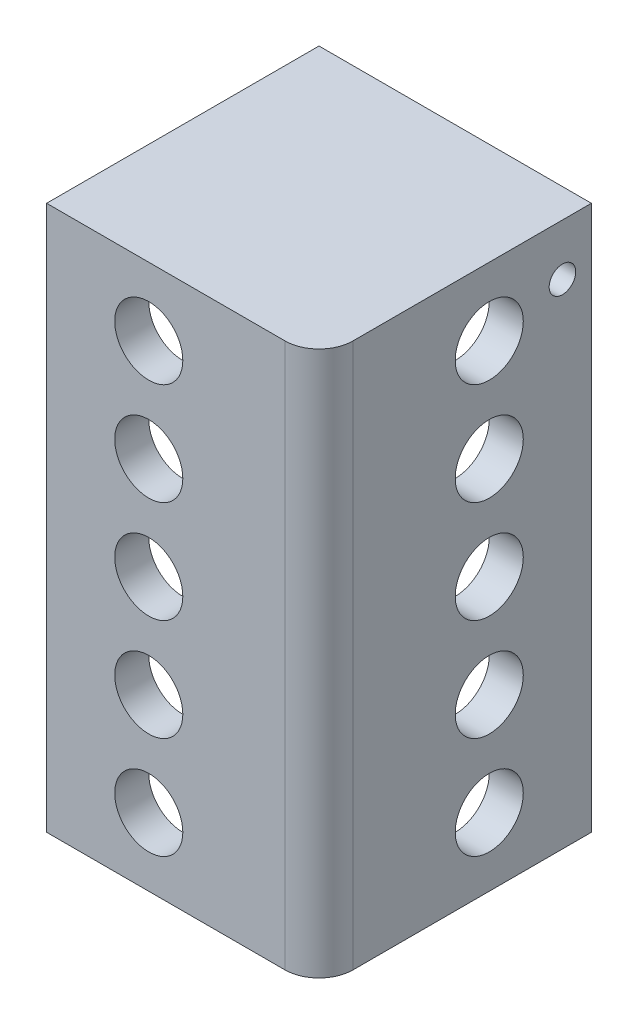
ISO-10303-21;
HEADER;
FILE_DESCRIPTION(('STEP AP214'),'2;1');
FILE_NAME('part.step','',(''),(''),'','','');
FILE_SCHEMA(('AUTOMOTIVE_DESIGN { 1 0 10303 214 1 1 1 1 }'));
ENDSEC;
DATA;
#1=APPLICATION_CONTEXT('core data for automotive mechanical design processes');
#2=APPLICATION_PROTOCOL_DEFINITION('international standard','automotive_design',2000,#1);
#3=PRODUCT_CONTEXT('',#1,'mechanical');
#4=PRODUCT('Part','Part','',(#3));
#5=PRODUCT_RELATED_PRODUCT_CATEGORY('part','',(#4));
#6=PRODUCT_DEFINITION_FORMATION('','',#4);
#7=PRODUCT_DEFINITION_CONTEXT('part definition',#1,'design');
#8=PRODUCT_DEFINITION('design','',#6,#7);
#9=PRODUCT_DEFINITION_SHAPE('','',#8);
#10=(LENGTH_UNIT() NAMED_UNIT(*) SI_UNIT(.MILLI.,.METRE.));
#11=(NAMED_UNIT(*) PLANE_ANGLE_UNIT() SI_UNIT($,.RADIAN.));
#12=(NAMED_UNIT(*) SI_UNIT($,.STERADIAN.) SOLID_ANGLE_UNIT());
#13=UNCERTAINTY_MEASURE_WITH_UNIT(LENGTH_MEASURE(1.E-05),#10,'distance_accuracy_value','');
#14=(GEOMETRIC_REPRESENTATION_CONTEXT(3) GLOBAL_UNCERTAINTY_ASSIGNED_CONTEXT((#13)) GLOBAL_UNIT_ASSIGNED_CONTEXT((#10,
#11,#12)) REPRESENTATION_CONTEXT('',''));
#15=CARTESIAN_POINT('',(0.,0.,0.));
#16=DIRECTION('',(0.,0.,1.));
#17=DIRECTION('',(1.,0.,0.));
#18=AXIS2_PLACEMENT_3D('',#15,#16,#17);
#19=CARTESIAN_POINT('',(0.,196.85,0.));
#20=DIRECTION('',(0.,1.,0.));
#21=DIRECTION('',(0.,0.,1.));
#22=AXIS2_PLACEMENT_3D('',#19,#20,#21);
#23=PLANE('',#22);
#24=DIRECTION('',(0.,0.,-1.));
#25=VECTOR('',#24,1.);
#26=CARTESIAN_POINT('',(7.67057768052518,196.85,-76.4778993435448));
#27=LINE('',#26,#25);
#28=CARTESIAN_POINT('',(7.67057768052518,196.85,-53.6178993435448));
#29=VERTEX_POINT('',#28);
#30=CARTESIAN_POINT('',(7.67057768052518,196.85,-76.4778993435448));
#31=VERTEX_POINT('',#30);
#32=EDGE_CURVE('E187',#29,#31,#27,.T.);
#33=ORIENTED_EDGE('',*,*,#32,.F.);
#34=DIRECTION('',(-1.,0.,0.));
#35=VECTOR('',#34,1.);
#36=CARTESIAN_POINT('',(7.67057768052518,196.85,-53.6178993435448));
#37=LINE('',#36,#35);
#38=CARTESIAN_POINT('',(16.5605776805252,196.85,-53.6178993435448));
#39=VERTEX_POINT('',#38);
#40=EDGE_CURVE('E199',#39,#29,#37,.T.);
#41=ORIENTED_EDGE('',*,*,#40,.F.);
#42=DIRECTION('',(0.,0.,1.));
#43=VECTOR('',#42,1.);
#44=CARTESIAN_POINT('',(16.5605776805252,196.85,-76.4778993435448));
#45=LINE('',#44,#43);
#46=CARTESIAN_POINT('',(16.5605776805252,196.85,-76.4778993435448));
#47=VERTEX_POINT('',#46);
#48=EDGE_CURVE('E203',#47,#39,#45,.T.);
#49=ORIENTED_EDGE('',*,*,#48,.F.);
#50=DIRECTION('',(-1.,0.,0.));
#51=VECTOR('',#50,1.);
#52=CARTESIAN_POINT('',(-41.3514223194748,196.85,-76.4778993435448));
#53=LINE('',#52,#51);
#54=CARTESIAN_POINT('',(28.4985776805252,196.85,-76.4778993435448));
#55=VERTEX_POINT('',#54);
#56=EDGE_CURVE('E295',#55,#47,#53,.T.);
#57=ORIENTED_EDGE('',*,*,#56,.F.);
#58=DIRECTION('',(0.,0.,-1.));
#59=VECTOR('',#58,1.);
#60=CARTESIAN_POINT('',(28.4985776805252,196.85,-53.6178993435448));
#61=LINE('',#60,#59);
#62=CARTESIAN_POINT('',(28.4985776805252,196.85,-53.6178993435448));
#63=VERTEX_POINT('',#62);
#64=EDGE_CURVE('E204',#63,#55,#61,.T.);
#65=ORIENTED_EDGE('',*,*,#64,.F.);
#66=DIRECTION('',(-1.,0.,0.));
#67=VECTOR('',#66,1.);
#68=CARTESIAN_POINT('',(28.4985776805252,196.85,-53.6178993435448));
#69=LINE('',#68,#67);
#70=CARTESIAN_POINT('',(37.3885776805252,196.85,-53.6178993435448));
#71=VERTEX_POINT('',#70);
#72=EDGE_CURVE('E229',#71,#63,#69,.T.);
#73=ORIENTED_EDGE('',*,*,#72,.F.);
#74=DIRECTION('',(0.,0.,1.));
#75=VECTOR('',#74,1.);
#76=CARTESIAN_POINT('',(37.3885776805252,196.85,-53.6178993435448));
#77=LINE('',#76,#75);
#78=CARTESIAN_POINT('',(37.3885776805252,196.85,-76.4778993435448));
#79=VERTEX_POINT('',#78);
#80=EDGE_CURVE('E232',#79,#71,#77,.T.);
#81=ORIENTED_EDGE('',*,*,#80,.F.);
#82=CARTESIAN_POINT('',(47.5485776805252,196.85,-76.4778993435448));
#83=VERTEX_POINT('',#82);
#84=EDGE_CURVE('E291',#83,#79,#53,.T.);
#85=ORIENTED_EDGE('',*,*,#84,.F.);
#86=DIRECTION('',(0.,0.,-1.));
#87=VECTOR('',#86,1.);
#88=CARTESIAN_POINT('',(47.5485776805252,196.85,-76.4778993435448));
#89=LINE('',#88,#87);
#90=CARTESIAN_POINT('',(47.5485776805252,196.85,-0.277899343544857));
#91=VERTEX_POINT('',#90);
#92=EDGE_CURVE('E289',#91,#83,#89,.T.);
#93=ORIENTED_EDGE('',*,*,#92,.F.);
#94=CARTESIAN_POINT('',(34.8485776805252,196.85,-0.277899343544857));
#95=DIRECTION('',(0.,1.,0.));
#96=DIRECTION('',(0.,0.,1.));
#97=AXIS2_PLACEMENT_3D('',#94,#95,#96);
#98=CIRCLE('',#97,12.7);
#99=CARTESIAN_POINT('',(34.8485776805252,196.85,12.4221006564551));
#100=VERTEX_POINT('',#99);
#101=EDGE_CURVE('E341',#91,#100,#98,.F.);
#102=ORIENTED_EDGE('',*,*,#101,.T.);
#103=DIRECTION('',(1.,0.,0.));
#104=VECTOR('',#103,1.);
#105=CARTESIAN_POINT('',(-41.3514223194748,196.85,12.4221006564551));
#106=LINE('',#105,#104);
#107=CARTESIAN_POINT('',(-41.3514223194748,196.85,12.4221006564551));
#108=VERTEX_POINT('',#107);
#109=EDGE_CURVE('E285',#108,#100,#106,.T.);
#110=ORIENTED_EDGE('',*,*,#109,.F.);
#111=DIRECTION('',(0.,0.,1.));
#112=VECTOR('',#111,1.);
#113=CARTESIAN_POINT('',(-41.3514223194748,196.85,-76.4778993435448));
#114=LINE('',#113,#112);
#115=CARTESIAN_POINT('',(-41.3514223194748,196.85,-76.4778993435448));
#116=VERTEX_POINT('',#115);
#117=EDGE_CURVE('E282',#116,#108,#114,.T.);
#118=ORIENTED_EDGE('',*,*,#117,.F.);
#119=EDGE_CURVE('E202',#31,#116,#53,.T.);
#120=ORIENTED_EDGE('',*,*,#119,.F.);
#121=EDGE_LOOP('',(#33,#41,#49,#57,#65,#73,#81,#85,#93,#102,#110,#118,#120));
#122=FACE_BOUND('',#121,.T.);
#123=ADVANCED_FACE('F41',(#122),#23,.F.);
#124=CARTESIAN_POINT('',(-41.3514223194748,203.2,-76.4778993435448));
#125=DIRECTION('',(1.,0.,0.));
#126=DIRECTION('',(0.,0.,-1.));
#127=AXIS2_PLACEMENT_3D('',#124,#125,#126);
#128=PLANE('',#127);
#129=DIRECTION('',(0.,-1.,0.));
#130=VECTOR('',#129,1.);
#131=CARTESIAN_POINT('',(-41.3514223194748,196.85,12.4221006564551));
#132=LINE('',#131,#130);
#133=CARTESIAN_POINT('',(-41.3514223194748,0.,12.4221006564551));
#134=VERTEX_POINT('',#133);
#135=EDGE_CURVE('E297',#108,#134,#132,.T.);
#136=ORIENTED_EDGE('',*,*,#135,.T.);
#137=DIRECTION('',(0.,0.,1.));
#138=VECTOR('',#137,1.);
#139=CARTESIAN_POINT('',(-41.3514223194748,0.,-76.4778993435448));
#140=LINE('',#139,#138);
#141=CARTESIAN_POINT('',(-41.3514223194748,0.,25.1221006564551));
#142=VERTEX_POINT('',#141);
#143=EDGE_CURVE('E299',#134,#142,#140,.T.);
#144=ORIENTED_EDGE('',*,*,#143,.T.);
#145=DIRECTION('',(0.,-1.,0.));
#146=VECTOR('',#145,1.);
#147=CARTESIAN_POINT('',(-41.3514223194748,203.2,25.1221006564551));
#148=LINE('',#147,#146);
#149=CARTESIAN_POINT('',(-41.3514223194748,203.2,25.1221006564551));
#150=VERTEX_POINT('',#149);
#151=EDGE_CURVE('E325',#150,#142,#148,.T.);
#152=ORIENTED_EDGE('',*,*,#151,.F.);
#153=DIRECTION('',(0.,0.,1.));
#154=VECTOR('',#153,1.);
#155=CARTESIAN_POINT('',(-41.3514223194748,203.2,-76.4778993435448));
#156=LINE('',#155,#154);
#157=CARTESIAN_POINT('',(-41.3514223194748,203.2,-76.4778993435448));
#158=VERTEX_POINT('',#157);
#159=EDGE_CURVE('E300',#158,#150,#156,.T.);
#160=ORIENTED_EDGE('',*,*,#159,.F.);
#161=DIRECTION('',(0.,-1.,0.));
#162=VECTOR('',#161,1.);
#163=CARTESIAN_POINT('',(-41.3514223194748,203.2,-76.4778993435448));
#164=LINE('',#163,#162);
#165=EDGE_CURVE('E311',#158,#116,#164,.T.);
#166=ORIENTED_EDGE('',*,*,#165,.T.);
#167=ORIENTED_EDGE('',*,*,#117,.T.);
#168=EDGE_LOOP('',(#136,#144,#152,#160,#166,#167));
#169=FACE_BOUND('',#168,.T.);
#170=ADVANCED_FACE('F458',(#169),#128,.F.);
#171=CARTESIAN_POINT('',(-41.3514223194748,203.2,25.1221006564551));
#172=DIRECTION('',(0.,0.,-1.));
#173=DIRECTION('',(-1.,0.,0.));
#174=AXIS2_PLACEMENT_3D('',#171,#172,#173);
#175=PLANE('',#174);
#176=CARTESIAN_POINT('',(-3.25142231947483,177.8,25.1221006564551));
#177=DIRECTION('',(0.,0.,1.));
#178=DIRECTION('',(1.,0.,0.));
#179=AXIS2_PLACEMENT_3D('',#176,#177,#178);
#180=CIRCLE('',#179,12.7);
#181=CARTESIAN_POINT('',(9.44857768052517,177.8,25.1221006564551));
#182=VERTEX_POINT('',#181);
#183=EDGE_CURVE('E265',#182,#182,#180,.T.);
#184=ORIENTED_EDGE('',*,*,#183,.F.);
#185=EDGE_LOOP('',(#184));
#186=FACE_BOUND('',#185,.T.);
#187=CARTESIAN_POINT('',(-3.25142231947483,139.7,25.1221006564551));
#188=DIRECTION('',(0.,0.,1.));
#189=DIRECTION('',(1.,0.,0.));
#190=AXIS2_PLACEMENT_3D('',#187,#188,#189);
#191=CIRCLE('',#190,12.7);
#192=CARTESIAN_POINT('',(9.44857768052517,139.7,25.1221006564551));
#193=VERTEX_POINT('',#192);
#194=EDGE_CURVE('E269',#193,#193,#191,.T.);
#195=ORIENTED_EDGE('',*,*,#194,.F.);
#196=EDGE_LOOP('',(#195));
#197=FACE_BOUND('',#196,.T.);
#198=CARTESIAN_POINT('',(-3.25142231947483,101.6,25.1221006564551));
#199=DIRECTION('',(0.,0.,1.));
#200=DIRECTION('',(1.,0.,0.));
#201=AXIS2_PLACEMENT_3D('',#198,#199,#200);
#202=CIRCLE('',#201,12.7);
#203=CARTESIAN_POINT('',(9.44857768052517,101.6,25.1221006564551));
#204=VERTEX_POINT('',#203);
#205=EDGE_CURVE('E272',#204,#204,#202,.T.);
#206=ORIENTED_EDGE('',*,*,#205,.F.);
#207=EDGE_LOOP('',(#206));
#208=FACE_BOUND('',#207,.T.);
#209=CARTESIAN_POINT('',(-3.25142231947483,63.5,25.1221006564551));
#210=DIRECTION('',(0.,0.,1.));
#211=DIRECTION('',(1.,0.,0.));
#212=AXIS2_PLACEMENT_3D('',#209,#210,#211);
#213=CIRCLE('',#212,12.7);
#214=CARTESIAN_POINT('',(9.44857768052517,63.5,25.1221006564551));
#215=VERTEX_POINT('',#214);
#216=EDGE_CURVE('E275',#215,#215,#213,.T.);
#217=ORIENTED_EDGE('',*,*,#216,.F.);
#218=EDGE_LOOP('',(#217));
#219=FACE_BOUND('',#218,.T.);
#220=CARTESIAN_POINT('',(-3.25142231947483,25.4,25.1221006564551));
#221=DIRECTION('',(0.,0.,1.));
#222=DIRECTION('',(1.,0.,0.));
#223=AXIS2_PLACEMENT_3D('',#220,#221,#222);
#224=CIRCLE('',#223,12.7);
#225=CARTESIAN_POINT('',(9.44857768052517,25.4,25.1221006564551));
#226=VERTEX_POINT('',#225);
#227=EDGE_CURVE('E278',#226,#226,#224,.T.);
#228=ORIENTED_EDGE('',*,*,#227,.F.);
#229=EDGE_LOOP('',(#228));
#230=FACE_BOUND('',#229,.T.);
#231=DIRECTION('',(1.,0.,0.));
#232=VECTOR('',#231,1.);
#233=CARTESIAN_POINT('',(-41.3514223194748,0.,25.1221006564551));
#234=LINE('',#233,#232);
#235=CARTESIAN_POINT('',(47.5485776805251,0.,25.1221006564551));
#236=VERTEX_POINT('',#235);
#237=EDGE_CURVE('E313',#142,#236,#234,.T.);
#238=ORIENTED_EDGE('',*,*,#237,.T.);
#239=DIRECTION('',(0.,-1.,0.));
#240=VECTOR('',#239,1.);
#241=CARTESIAN_POINT('',(47.5485776805251,203.2,25.1221006564551));
#242=LINE('',#241,#240);
#243=CARTESIAN_POINT('',(47.5485776805251,203.2,25.1221006564551));
#244=VERTEX_POINT('',#243);
#245=EDGE_CURVE('E333',#236,#244,#242,.F.);
#246=ORIENTED_EDGE('',*,*,#245,.T.);
#247=DIRECTION('',(1.,0.,0.));
#248=VECTOR('',#247,1.);
#249=CARTESIAN_POINT('',(-41.3514223194748,203.2,25.1221006564551));
#250=LINE('',#249,#248);
#251=EDGE_CURVE('E303',#150,#244,#250,.T.);
#252=ORIENTED_EDGE('',*,*,#251,.F.);
#253=ORIENTED_EDGE('',*,*,#151,.T.);
#254=EDGE_LOOP('',(#238,#246,#252,#253));
#255=FACE_BOUND('',#254,.T.);
#256=ADVANCED_FACE('F475',(#186,#197,#208,#219,#230,#255),#175,.F.);
#257=CARTESIAN_POINT('',(60.2485776805252,203.2,-76.4778993435448));
#258=DIRECTION('',(-1.,0.,0.));
#259=DIRECTION('',(0.,0.,1.));
#260=AXIS2_PLACEMENT_3D('',#257,#258,#259);
#261=PLANE('',#260);
#262=CARTESIAN_POINT('',(60.2485776805252,184.023,-65.6828993435448));
#263=DIRECTION('',(-1.,0.,0.));
#264=DIRECTION('',(0.,0.,1.));
#265=AXIS2_PLACEMENT_3D('',#262,#263,#264);
#266=CIRCLE('',#265,4.953);
#267=CARTESIAN_POINT('',(60.2485776805252,184.023,-60.7298993435449));
#268=VERTEX_POINT('',#267);
#269=EDGE_CURVE('E613',#268,#268,#266,.T.);
#270=ORIENTED_EDGE('',*,*,#269,.T.);
#271=EDGE_LOOP('',(#270));
#272=FACE_BOUND('',#271,.T.);
#273=CARTESIAN_POINT('',(60.2485776805252,177.8,-38.3778993435448));
#274=DIRECTION('',(1.,0.,0.));
#275=DIRECTION('',(0.,0.,-1.));
#276=AXIS2_PLACEMENT_3D('',#273,#274,#275);
#277=CIRCLE('',#276,12.7);
#278=CARTESIAN_POINT('',(60.2485776805252,177.8,-51.0778993435448));
#279=VERTEX_POINT('',#278);
#280=EDGE_CURVE('E250',#279,#279,#277,.T.);
#281=ORIENTED_EDGE('',*,*,#280,.F.);
#282=EDGE_LOOP('',(#281));
#283=FACE_BOUND('',#282,.T.);
#284=CARTESIAN_POINT('',(60.2485776805252,139.7,-38.3778993435448));
#285=DIRECTION('',(1.,0.,0.));
#286=DIRECTION('',(0.,0.,-1.));
#287=AXIS2_PLACEMENT_3D('',#284,#285,#286);
#288=CIRCLE('',#287,12.7);
#289=CARTESIAN_POINT('',(60.2485776805252,139.7,-51.0778993435448));
#290=VERTEX_POINT('',#289);
#291=EDGE_CURVE('E254',#290,#290,#288,.T.);
#292=ORIENTED_EDGE('',*,*,#291,.F.);
#293=EDGE_LOOP('',(#292));
#294=FACE_BOUND('',#293,.T.);
#295=CARTESIAN_POINT('',(60.2485776805252,101.6,-38.3778993435448));
#296=DIRECTION('',(1.,0.,0.));
#297=DIRECTION('',(0.,0.,-1.));
#298=AXIS2_PLACEMENT_3D('',#295,#296,#297);
#299=CIRCLE('',#298,12.7);
#300=CARTESIAN_POINT('',(60.2485776805252,101.6,-51.0778993435448));
#301=VERTEX_POINT('',#300);
#302=EDGE_CURVE('E257',#301,#301,#299,.T.);
#303=ORIENTED_EDGE('',*,*,#302,.F.);
#304=EDGE_LOOP('',(#303));
#305=FACE_BOUND('',#304,.T.);
#306=CARTESIAN_POINT('',(60.2485776805252,63.5,-38.3778993435448));
#307=DIRECTION('',(1.,0.,0.));
#308=DIRECTION('',(0.,0.,-1.));
#309=AXIS2_PLACEMENT_3D('',#306,#307,#308);
#310=CIRCLE('',#309,12.7);
#311=CARTESIAN_POINT('',(60.2485776805252,63.5,-51.0778993435448));
#312=VERTEX_POINT('',#311);
#313=EDGE_CURVE('E260',#312,#312,#310,.T.);
#314=ORIENTED_EDGE('',*,*,#313,.F.);
#315=EDGE_LOOP('',(#314));
#316=FACE_BOUND('',#315,.T.);
#317=CARTESIAN_POINT('',(60.2485776805252,25.4,-38.3778993435448));
#318=DIRECTION('',(1.,0.,0.));
#319=DIRECTION('',(0.,0.,-1.));
#320=AXIS2_PLACEMENT_3D('',#317,#318,#319);
#321=CIRCLE('',#320,12.7);
#322=CARTESIAN_POINT('',(60.2485776805252,25.4,-51.0778993435448));
#323=VERTEX_POINT('',#322);
#324=EDGE_CURVE('E249',#323,#323,#321,.T.);
#325=ORIENTED_EDGE('',*,*,#324,.F.);
#326=EDGE_LOOP('',(#325));
#327=FACE_BOUND('',#326,.T.);
#328=DIRECTION('',(0.,0.,-1.));
#329=VECTOR('',#328,1.);
#330=CARTESIAN_POINT('',(60.2485776805252,203.2,-76.4778993435448));
#331=LINE('',#330,#329);
#332=CARTESIAN_POINT('',(60.2485776805252,203.2,12.4221006564551));
#333=VERTEX_POINT('',#332);
#334=CARTESIAN_POINT('',(60.2485776805252,203.2,-76.4778993435448));
#335=VERTEX_POINT('',#334);
#336=EDGE_CURVE('E307',#333,#335,#331,.T.);
#337=ORIENTED_EDGE('',*,*,#336,.F.);
#338=DIRECTION('',(0.,-1.,0.));
#339=VECTOR('',#338,1.);
#340=CARTESIAN_POINT('',(60.2485776805252,203.2,12.4221006564551));
#341=LINE('',#340,#339);
#342=CARTESIAN_POINT('',(60.2485776805252,0.,12.4221006564551));
#343=VERTEX_POINT('',#342);
#344=EDGE_CURVE('E328',#333,#343,#341,.T.);
#345=ORIENTED_EDGE('',*,*,#344,.T.);
#346=DIRECTION('',(0.,0.,-1.));
#347=VECTOR('',#346,1.);
#348=CARTESIAN_POINT('',(60.2485776805252,0.,-76.4778993435448));
#349=LINE('',#348,#347);
#350=CARTESIAN_POINT('',(60.2485776805252,0.,-76.4778993435448));
#351=VERTEX_POINT('',#350);
#352=EDGE_CURVE('E316',#343,#351,#349,.T.);
#353=ORIENTED_EDGE('',*,*,#352,.T.);
#354=DIRECTION('',(0.,-1.,0.));
#355=VECTOR('',#354,1.);
#356=CARTESIAN_POINT('',(60.2485776805252,203.2,-76.4778993435448));
#357=LINE('',#356,#355);
#358=EDGE_CURVE('E322',#335,#351,#357,.T.);
#359=ORIENTED_EDGE('',*,*,#358,.F.);
#360=EDGE_LOOP('',(#337,#345,#353,#359));
#361=FACE_BOUND('',#360,.T.);
#362=ADVANCED_FACE('F470',(#272,#283,#294,#305,#316,#327,#361),#261,.F.);
#363=CARTESIAN_POINT('',(-41.3514223194748,203.2,-76.4778993435448));
#364=DIRECTION('',(0.,0.,1.));
#365=DIRECTION('',(1.,0.,0.));
#366=AXIS2_PLACEMENT_3D('',#363,#364,#365);
#367=PLANE('',#366);
#368=DIRECTION('',(0.,1.,0.));
#369=VECTOR('',#368,1.);
#370=CARTESIAN_POINT('',(37.3885776805252,171.45,-76.4778993435448));
#371=LINE('',#370,#369);
#372=CARTESIAN_POINT('',(37.3885776805252,184.15,-76.4778993435448));
#373=VERTEX_POINT('',#372);
#374=EDGE_CURVE('E221',#373,#79,#371,.T.);
#375=ORIENTED_EDGE('',*,*,#374,.F.);
#376=DIRECTION('',(1.,0.,0.));
#377=VECTOR('',#376,1.);
#378=CARTESIAN_POINT('',(28.4985776805252,184.15,-76.4778993435448));
#379=LINE('',#378,#377);
#380=CARTESIAN_POINT('',(28.4985776805252,184.15,-76.4778993435448));
#381=VERTEX_POINT('',#380);
#382=EDGE_CURVE('E395',#373,#381,#379,.F.);
#383=ORIENTED_EDGE('',*,*,#382,.T.);
#384=DIRECTION('',(0.,1.,0.));
#385=VECTOR('',#384,1.);
#386=CARTESIAN_POINT('',(28.4985776805252,171.45,-76.4778993435448));
#387=LINE('',#386,#385);
#388=EDGE_CURVE('E219',#381,#55,#387,.T.);
#389=ORIENTED_EDGE('',*,*,#388,.T.);
#390=ORIENTED_EDGE('',*,*,#56,.T.);
#391=DIRECTION('',(0.,1.,0.));
#392=VECTOR('',#391,1.);
#393=CARTESIAN_POINT('',(16.5605776805252,171.45,-76.4778993435448));
#394=LINE('',#393,#392);
#395=CARTESIAN_POINT('',(16.5605776805252,184.15,-76.4778993435448));
#396=VERTEX_POINT('',#395);
#397=EDGE_CURVE('E214',#396,#47,#394,.T.);
#398=ORIENTED_EDGE('',*,*,#397,.F.);
#399=DIRECTION('',(1.,0.,0.));
#400=VECTOR('',#399,1.);
#401=CARTESIAN_POINT('',(-41.3514223194748,184.15,-76.4778993435448));
#402=LINE('',#401,#400);
#403=CARTESIAN_POINT('',(7.67057768052518,184.15,-76.4778993435448));
#404=VERTEX_POINT('',#403);
#405=EDGE_CURVE('E393',#396,#404,#402,.F.);
#406=ORIENTED_EDGE('',*,*,#405,.T.);
#407=DIRECTION('',(0.,1.,0.));
#408=VECTOR('',#407,1.);
#409=CARTESIAN_POINT('',(7.67057768052518,171.45,-76.4778993435448));
#410=LINE('',#409,#408);
#411=EDGE_CURVE('E216',#404,#31,#410,.T.);
#412=ORIENTED_EDGE('',*,*,#411,.T.);
#413=ORIENTED_EDGE('',*,*,#119,.T.);
#414=ORIENTED_EDGE('',*,*,#165,.F.);
#415=DIRECTION('',(-1.,0.,0.));
#416=VECTOR('',#415,1.);
#417=CARTESIAN_POINT('',(-41.3514223194748,203.2,-76.4778993435448));
#418=LINE('',#417,#416);
#419=EDGE_CURVE('E309',#335,#158,#418,.T.);
#420=ORIENTED_EDGE('',*,*,#419,.F.);
#421=ORIENTED_EDGE('',*,*,#358,.T.);
#422=DIRECTION('',(-1.,0.,0.));
#423=VECTOR('',#422,1.);
#424=CARTESIAN_POINT('',(-41.3514223194748,0.,-76.4778993435448));
#425=LINE('',#424,#423);
#426=CARTESIAN_POINT('',(47.5485776805252,0.,-76.4778993435448));
#427=VERTEX_POINT('',#426);
#428=EDGE_CURVE('E304',#351,#427,#425,.T.);
#429=ORIENTED_EDGE('',*,*,#428,.T.);
#430=DIRECTION('',(0.,-1.,0.));
#431=VECTOR('',#430,1.);
#432=CARTESIAN_POINT('',(47.5485776805252,196.85,-76.4778993435448));
#433=LINE('',#432,#431);
#434=EDGE_CURVE('E294',#83,#427,#433,.T.);
#435=ORIENTED_EDGE('',*,*,#434,.F.);
#436=ORIENTED_EDGE('',*,*,#84,.T.);
#437=EDGE_LOOP('',(#375,#383,#389,#390,#398,#406,#412,#413,#414,#420,#421,#429,#435,#436));
#438=FACE_BOUND('',#437,.T.);
#439=ADVANCED_FACE('F408',(#438),#367,.F.);
#440=CARTESIAN_POINT('',(0.,203.2,0.));
#441=DIRECTION('',(0.,1.,0.));
#442=DIRECTION('',(0.,0.,1.));
#443=AXIS2_PLACEMENT_3D('',#440,#441,#442);
#444=PLANE('',#443);
#445=ORIENTED_EDGE('',*,*,#251,.T.);
#446=CARTESIAN_POINT('',(47.5485776805252,203.2,12.4221006564551));
#447=DIRECTION('',(0.,1.,0.));
#448=DIRECTION('',(0.,0.,1.));
#449=AXIS2_PLACEMENT_3D('',#446,#447,#448);
#450=CIRCLE('',#449,12.7);
#451=EDGE_CURVE('E335',#244,#333,#450,.T.);
#452=ORIENTED_EDGE('',*,*,#451,.T.);
#453=ORIENTED_EDGE('',*,*,#336,.T.);
#454=ORIENTED_EDGE('',*,*,#419,.T.);
#455=ORIENTED_EDGE('',*,*,#159,.T.);
#456=EDGE_LOOP('',(#445,#452,#453,#454,#455));
#457=FACE_BOUND('',#456,.T.);
#458=ADVANCED_FACE('F465',(#457),#444,.T.);
#459=CARTESIAN_POINT('',(0.,0.,0.));
#460=DIRECTION('',(0.,1.,0.));
#461=DIRECTION('',(0.,0.,1.));
#462=AXIS2_PLACEMENT_3D('',#459,#460,#461);
#463=PLANE('',#462);
#464=CARTESIAN_POINT('',(34.8485776805252,0.,-0.277899343544854));
#465=DIRECTION('',(0.,1.,0.));
#466=DIRECTION('',(0.,0.,1.));
#467=AXIS2_PLACEMENT_3D('',#464,#465,#466);
#468=CIRCLE('',#467,12.7);
#469=CARTESIAN_POINT('',(34.8485776805251,0.,12.4221006564551));
#470=VERTEX_POINT('',#469);
#471=CARTESIAN_POINT('',(47.5485776805252,0.,-0.277899343544948));
#472=VERTEX_POINT('',#471);
#473=EDGE_CURVE('E243',#470,#472,#468,.T.);
#474=ORIENTED_EDGE('',*,*,#473,.T.);
#475=DIRECTION('',(0.,0.,-1.));
#476=VECTOR('',#475,1.);
#477=CARTESIAN_POINT('',(47.5485776805252,0.,-76.4778993435448));
#478=LINE('',#477,#476);
#479=EDGE_CURVE('E246',#472,#427,#478,.T.);
#480=ORIENTED_EDGE('',*,*,#479,.T.);
#481=ORIENTED_EDGE('',*,*,#428,.F.);
#482=ORIENTED_EDGE('',*,*,#352,.F.);
#483=CARTESIAN_POINT('',(47.5485776805252,0.,12.4221006564551));
#484=DIRECTION('',(0.,1.,0.));
#485=DIRECTION('',(0.,0.,1.));
#486=AXIS2_PLACEMENT_3D('',#483,#484,#485);
#487=CIRCLE('',#486,12.7);
#488=EDGE_CURVE('E331',#343,#236,#487,.F.);
#489=ORIENTED_EDGE('',*,*,#488,.T.);
#490=ORIENTED_EDGE('',*,*,#237,.F.);
#491=ORIENTED_EDGE('',*,*,#143,.F.);
#492=DIRECTION('',(1.,0.,0.));
#493=VECTOR('',#492,1.);
#494=CARTESIAN_POINT('',(-41.3514223194748,0.,12.4221006564551));
#495=LINE('',#494,#493);
#496=EDGE_CURVE('E218',#134,#470,#495,.T.);
#497=ORIENTED_EDGE('',*,*,#496,.T.);
#498=EDGE_LOOP('',(#474,#480,#481,#482,#489,#490,#491,#497));
#499=FACE_BOUND('',#498,.T.);
#500=ADVANCED_FACE('F445',(#499),#463,.F.);
#501=CARTESIAN_POINT('',(-41.3514223194748,196.85,12.4221006564551));
#502=DIRECTION('',(0.,0.,-1.));
#503=DIRECTION('',(-1.,0.,0.));
#504=AXIS2_PLACEMENT_3D('',#501,#502,#503);
#505=PLANE('',#504);
#506=CARTESIAN_POINT('',(-3.25142231947483,177.8,12.4221006564551));
#507=DIRECTION('',(0.,0.,-1.));
#508=DIRECTION('',(-1.,0.,0.));
#509=AXIS2_PLACEMENT_3D('',#506,#507,#508);
#510=CIRCLE('',#509,12.7);
#511=CARTESIAN_POINT('',(-15.9514223194748,177.8,12.4221006564551));
#512=VERTEX_POINT('',#511);
#513=EDGE_CURVE('E286',#512,#512,#510,.T.);
#514=ORIENTED_EDGE('',*,*,#513,.F.);
#515=EDGE_LOOP('',(#514));
#516=FACE_BOUND('',#515,.T.);
#517=CARTESIAN_POINT('',(-3.25142231947483,139.7,12.4221006564551));
#518=DIRECTION('',(0.,0.,-1.));
#519=DIRECTION('',(-1.,0.,0.));
#520=AXIS2_PLACEMENT_3D('',#517,#518,#519);
#521=CIRCLE('',#520,12.7);
#522=CARTESIAN_POINT('',(-15.9514223194748,139.7,12.4221006564551));
#523=VERTEX_POINT('',#522);
#524=EDGE_CURVE('E352',#523,#523,#521,.T.);
#525=ORIENTED_EDGE('',*,*,#524,.F.);
#526=EDGE_LOOP('',(#525));
#527=FACE_BOUND('',#526,.T.);
#528=CARTESIAN_POINT('',(-3.25142231947483,101.6,12.4221006564551));
#529=DIRECTION('',(0.,0.,-1.));
#530=DIRECTION('',(-1.,0.,0.));
#531=AXIS2_PLACEMENT_3D('',#528,#529,#530);
#532=CIRCLE('',#531,12.7);
#533=CARTESIAN_POINT('',(-15.9514223194748,101.6,12.4221006564551));
#534=VERTEX_POINT('',#533);
#535=EDGE_CURVE('E349',#534,#534,#532,.T.);
#536=ORIENTED_EDGE('',*,*,#535,.F.);
#537=EDGE_LOOP('',(#536));
#538=FACE_BOUND('',#537,.T.);
#539=CARTESIAN_POINT('',(-3.25142231947483,63.5,12.4221006564551));
#540=DIRECTION('',(0.,0.,-1.));
#541=DIRECTION('',(-1.,0.,0.));
#542=AXIS2_PLACEMENT_3D('',#539,#540,#541);
#543=CIRCLE('',#542,12.7);
#544=CARTESIAN_POINT('',(-15.9514223194748,63.5,12.4221006564551));
#545=VERTEX_POINT('',#544);
#546=EDGE_CURVE('E346',#545,#545,#543,.T.);
#547=ORIENTED_EDGE('',*,*,#546,.F.);
#548=EDGE_LOOP('',(#547));
#549=FACE_BOUND('',#548,.T.);
#550=CARTESIAN_POINT('',(-3.25142231947483,25.4,12.4221006564551));
#551=DIRECTION('',(0.,0.,-1.));
#552=DIRECTION('',(-1.,0.,0.));
#553=AXIS2_PLACEMENT_3D('',#550,#551,#552);
#554=CIRCLE('',#553,12.7);
#555=CARTESIAN_POINT('',(-15.9514223194748,25.4,12.4221006564551));
#556=VERTEX_POINT('',#555);
#557=EDGE_CURVE('E268',#556,#556,#554,.T.);
#558=ORIENTED_EDGE('',*,*,#557,.F.);
#559=EDGE_LOOP('',(#558));
#560=FACE_BOUND('',#559,.T.);
#561=ORIENTED_EDGE('',*,*,#109,.T.);
#562=DIRECTION('',(0.,-1.,0.));
#563=VECTOR('',#562,1.);
#564=CARTESIAN_POINT('',(34.8485776805252,6.34999999999999,12.4221006564551));
#565=LINE('',#564,#563);
#566=EDGE_CURVE('E337',#100,#470,#565,.T.);
#567=ORIENTED_EDGE('',*,*,#566,.T.);
#568=ORIENTED_EDGE('',*,*,#496,.F.);
#569=ORIENTED_EDGE('',*,*,#135,.F.);
#570=EDGE_LOOP('',(#561,#567,#568,#569));
#571=FACE_BOUND('',#570,.T.);
#572=ADVANCED_FACE('F456',(#516,#527,#538,#549,#560,#571),#505,.T.);
#573=CARTESIAN_POINT('',(47.5485776805252,196.85,-76.4778993435448));
#574=DIRECTION('',(-1.,0.,0.));
#575=DIRECTION('',(0.,0.,1.));
#576=AXIS2_PLACEMENT_3D('',#573,#574,#575);
#577=PLANE('',#576);
#578=CARTESIAN_POINT('',(47.5485776805252,184.023,-65.6828993435448));
#579=DIRECTION('',(-1.,0.,0.));
#580=DIRECTION('',(0.,0.,1.));
#581=AXIS2_PLACEMENT_3D('',#578,#579,#580);
#582=CIRCLE('',#581,4.953);
#583=CARTESIAN_POINT('',(47.5485776805252,184.023,-60.7298993435449));
#584=VERTEX_POINT('',#583);
#585=EDGE_CURVE('E222',#584,#584,#582,.T.);
#586=ORIENTED_EDGE('',*,*,#585,.F.);
#587=EDGE_LOOP('',(#586));
#588=FACE_BOUND('',#587,.T.);
#589=CARTESIAN_POINT('',(47.5485776805252,177.8,-38.3778993435448));
#590=DIRECTION('',(-1.,0.,0.));
#591=DIRECTION('',(0.,0.,1.));
#592=AXIS2_PLACEMENT_3D('',#589,#590,#591);
#593=CIRCLE('',#592,12.7);
#594=CARTESIAN_POINT('',(47.5485776805252,177.8,-25.6778993435448));
#595=VERTEX_POINT('',#594);
#596=EDGE_CURVE('E281',#595,#595,#593,.T.);
#597=ORIENTED_EDGE('',*,*,#596,.F.);
#598=EDGE_LOOP('',(#597));
#599=FACE_BOUND('',#598,.T.);
#600=CARTESIAN_POINT('',(47.5485776805252,139.7,-38.3778993435448));
#601=DIRECTION('',(-1.,0.,0.));
#602=DIRECTION('',(0.,0.,1.));
#603=AXIS2_PLACEMENT_3D('',#600,#601,#602);
#604=CIRCLE('',#603,12.7);
#605=CARTESIAN_POINT('',(47.5485776805252,139.7,-25.6778993435448));
#606=VERTEX_POINT('',#605);
#607=EDGE_CURVE('E365',#606,#606,#604,.T.);
#608=ORIENTED_EDGE('',*,*,#607,.F.);
#609=EDGE_LOOP('',(#608));
#610=FACE_BOUND('',#609,.T.);
#611=CARTESIAN_POINT('',(47.5485776805252,101.6,-38.3778993435448));
#612=DIRECTION('',(-1.,0.,0.));
#613=DIRECTION('',(0.,0.,1.));
#614=AXIS2_PLACEMENT_3D('',#611,#612,#613);
#615=CIRCLE('',#614,12.7);
#616=CARTESIAN_POINT('',(47.5485776805252,101.6,-25.6778993435448));
#617=VERTEX_POINT('',#616);
#618=EDGE_CURVE('E362',#617,#617,#615,.T.);
#619=ORIENTED_EDGE('',*,*,#618,.F.);
#620=EDGE_LOOP('',(#619));
#621=FACE_BOUND('',#620,.T.);
#622=CARTESIAN_POINT('',(47.5485776805252,63.5,-38.3778993435448));
#623=DIRECTION('',(-1.,0.,0.));
#624=DIRECTION('',(0.,0.,1.));
#625=AXIS2_PLACEMENT_3D('',#622,#623,#624);
#626=CIRCLE('',#625,12.7);
#627=CARTESIAN_POINT('',(47.5485776805252,63.5,-25.6778993435448));
#628=VERTEX_POINT('',#627);
#629=EDGE_CURVE('E359',#628,#628,#626,.T.);
#630=ORIENTED_EDGE('',*,*,#629,.F.);
#631=EDGE_LOOP('',(#630));
#632=FACE_BOUND('',#631,.T.);
#633=CARTESIAN_POINT('',(47.5485776805252,25.4,-38.3778993435448));
#634=DIRECTION('',(-1.,0.,0.));
#635=DIRECTION('',(0.,0.,1.));
#636=AXIS2_PLACEMENT_3D('',#633,#634,#635);
#637=CIRCLE('',#636,12.7);
#638=CARTESIAN_POINT('',(47.5485776805252,25.4,-25.6778993435448));
#639=VERTEX_POINT('',#638);
#640=EDGE_CURVE('E253',#639,#639,#637,.T.);
#641=ORIENTED_EDGE('',*,*,#640,.F.);
#642=EDGE_LOOP('',(#641));
#643=FACE_BOUND('',#642,.T.);
#644=ORIENTED_EDGE('',*,*,#434,.T.);
#645=ORIENTED_EDGE('',*,*,#479,.F.);
#646=DIRECTION('',(0.,-1.,0.));
#647=VECTOR('',#646,1.);
#648=CARTESIAN_POINT('',(47.5485776805252,196.85,-0.277899343544859));
#649=LINE('',#648,#647);
#650=EDGE_CURVE('E339',#472,#91,#649,.F.);
#651=ORIENTED_EDGE('',*,*,#650,.T.);
#652=ORIENTED_EDGE('',*,*,#92,.T.);
#653=EDGE_LOOP('',(#644,#645,#651,#652));
#654=FACE_BOUND('',#653,.T.);
#655=ADVANCED_FACE('F443',(#588,#599,#610,#621,#632,#643,#654),#577,.T.);
#656=CARTESIAN_POINT('',(47.5485776805252,203.2,12.4221006564551));
#657=DIRECTION('',(0.,-1.,0.));
#658=DIRECTION('',(0.,0.,-1.));
#659=AXIS2_PLACEMENT_3D('',#656,#657,#658);
#660=CYLINDRICAL_SURFACE('',#659,12.7);
#661=ORIENTED_EDGE('',*,*,#451,.F.);
#662=ORIENTED_EDGE('',*,*,#245,.F.);
#663=ORIENTED_EDGE('',*,*,#488,.F.);
#664=ORIENTED_EDGE('',*,*,#344,.F.);
#665=EDGE_LOOP('',(#661,#662,#663,#664));
#666=FACE_BOUND('',#665,.T.);
#667=ADVANCED_FACE('F476',(#666),#660,.T.);
#668=CARTESIAN_POINT('',(34.8485776805252,196.85,-0.277899343544857));
#669=DIRECTION('',(0.,1.,0.));
#670=DIRECTION('',(0.,0.,1.));
#671=AXIS2_PLACEMENT_3D('',#668,#669,#670);
#672=CYLINDRICAL_SURFACE('',#671,12.7);
#673=ORIENTED_EDGE('',*,*,#101,.F.);
#674=ORIENTED_EDGE('',*,*,#650,.F.);
#675=ORIENTED_EDGE('',*,*,#473,.F.);
#676=ORIENTED_EDGE('',*,*,#566,.F.);
#677=EDGE_LOOP('',(#673,#674,#675,#676));
#678=FACE_BOUND('',#677,.T.);
#679=ADVANCED_FACE('F453',(#678),#672,.F.);
#680=CARTESIAN_POINT('',(-3.25142231947483,25.4,-76.4778993435448));
#681=DIRECTION('',(0.,0.,1.));
#682=DIRECTION('',(1.,0.,0.));
#683=AXIS2_PLACEMENT_3D('',#680,#681,#682);
#684=CYLINDRICAL_SURFACE('',#683,12.7);
#685=ORIENTED_EDGE('',*,*,#557,.T.);
#686=EDGE_LOOP('',(#685));
#687=FACE_BOUND('',#686,.T.);
#688=ORIENTED_EDGE('',*,*,#227,.T.);
#689=EDGE_LOOP('',(#688));
#690=FACE_BOUND('',#689,.T.);
#691=ADVANCED_FACE('F484',(#687,#690),#684,.F.);
#692=CARTESIAN_POINT('',(-3.25142231947483,63.5,-76.4778993435448));
#693=DIRECTION('',(0.,0.,1.));
#694=DIRECTION('',(1.,0.,0.));
#695=AXIS2_PLACEMENT_3D('',#692,#693,#694);
#696=CYLINDRICAL_SURFACE('',#695,12.7);
#697=ORIENTED_EDGE('',*,*,#546,.T.);
#698=EDGE_LOOP('',(#697));
#699=FACE_BOUND('',#698,.T.);
#700=ORIENTED_EDGE('',*,*,#216,.T.);
#701=EDGE_LOOP('',(#700));
#702=FACE_BOUND('',#701,.T.);
#703=ADVANCED_FACE('F524',(#699,#702),#696,.F.);
#704=CARTESIAN_POINT('',(-3.25142231947483,101.6,-76.4778993435448));
#705=DIRECTION('',(0.,0.,1.));
#706=DIRECTION('',(1.,0.,0.));
#707=AXIS2_PLACEMENT_3D('',#704,#705,#706);
#708=CYLINDRICAL_SURFACE('',#707,12.7);
#709=ORIENTED_EDGE('',*,*,#535,.T.);
#710=EDGE_LOOP('',(#709));
#711=FACE_BOUND('',#710,.T.);
#712=ORIENTED_EDGE('',*,*,#205,.T.);
#713=EDGE_LOOP('',(#712));
#714=FACE_BOUND('',#713,.T.);
#715=ADVANCED_FACE('F529',(#711,#714),#708,.F.);
#716=CARTESIAN_POINT('',(-3.25142231947483,139.7,-76.4778993435448));
#717=DIRECTION('',(0.,0.,1.));
#718=DIRECTION('',(1.,0.,0.));
#719=AXIS2_PLACEMENT_3D('',#716,#717,#718);
#720=CYLINDRICAL_SURFACE('',#719,12.7);
#721=ORIENTED_EDGE('',*,*,#524,.T.);
#722=EDGE_LOOP('',(#721));
#723=FACE_BOUND('',#722,.T.);
#724=ORIENTED_EDGE('',*,*,#194,.T.);
#725=EDGE_LOOP('',(#724));
#726=FACE_BOUND('',#725,.T.);
#727=ADVANCED_FACE('F536',(#723,#726),#720,.F.);
#728=CARTESIAN_POINT('',(-3.25142231947483,177.8,-76.4778993435448));
#729=DIRECTION('',(0.,0.,1.));
#730=DIRECTION('',(1.,0.,0.));
#731=AXIS2_PLACEMENT_3D('',#728,#729,#730);
#732=CYLINDRICAL_SURFACE('',#731,12.7);
#733=ORIENTED_EDGE('',*,*,#513,.T.);
#734=EDGE_LOOP('',(#733));
#735=FACE_BOUND('',#734,.T.);
#736=ORIENTED_EDGE('',*,*,#183,.T.);
#737=EDGE_LOOP('',(#736));
#738=FACE_BOUND('',#737,.T.);
#739=ADVANCED_FACE('F543',(#735,#738),#732,.F.);
#740=CARTESIAN_POINT('',(-41.3514223194748,25.4,-38.3778993435448));
#741=DIRECTION('',(1.,0.,0.));
#742=DIRECTION('',(0.,0.,-1.));
#743=AXIS2_PLACEMENT_3D('',#740,#741,#742);
#744=CYLINDRICAL_SURFACE('',#743,12.7);
#745=ORIENTED_EDGE('',*,*,#640,.T.);
#746=EDGE_LOOP('',(#745));
#747=FACE_BOUND('',#746,.T.);
#748=ORIENTED_EDGE('',*,*,#324,.T.);
#749=EDGE_LOOP('',(#748));
#750=FACE_BOUND('',#749,.T.);
#751=ADVANCED_FACE('F547',(#747,#750),#744,.F.);
#752=CARTESIAN_POINT('',(-41.3514223194748,63.5,-38.3778993435448));
#753=DIRECTION('',(1.,0.,0.));
#754=DIRECTION('',(0.,0.,-1.));
#755=AXIS2_PLACEMENT_3D('',#752,#753,#754);
#756=CYLINDRICAL_SURFACE('',#755,12.7);
#757=ORIENTED_EDGE('',*,*,#629,.T.);
#758=EDGE_LOOP('',(#757));
#759=FACE_BOUND('',#758,.T.);
#760=ORIENTED_EDGE('',*,*,#313,.T.);
#761=EDGE_LOOP('',(#760));
#762=FACE_BOUND('',#761,.T.);
#763=ADVANCED_FACE('F551',(#759,#762),#756,.F.);
#764=CARTESIAN_POINT('',(-41.3514223194748,101.6,-38.3778993435448));
#765=DIRECTION('',(1.,0.,0.));
#766=DIRECTION('',(0.,0.,-1.));
#767=AXIS2_PLACEMENT_3D('',#764,#765,#766);
#768=CYLINDRICAL_SURFACE('',#767,12.7);
#769=ORIENTED_EDGE('',*,*,#618,.T.);
#770=EDGE_LOOP('',(#769));
#771=FACE_BOUND('',#770,.T.);
#772=ORIENTED_EDGE('',*,*,#302,.T.);
#773=EDGE_LOOP('',(#772));
#774=FACE_BOUND('',#773,.T.);
#775=ADVANCED_FACE('F555',(#771,#774),#768,.F.);
#776=CARTESIAN_POINT('',(-41.3514223194748,139.7,-38.3778993435448));
#777=DIRECTION('',(1.,0.,0.));
#778=DIRECTION('',(0.,0.,-1.));
#779=AXIS2_PLACEMENT_3D('',#776,#777,#778);
#780=CYLINDRICAL_SURFACE('',#779,12.7);
#781=ORIENTED_EDGE('',*,*,#607,.T.);
#782=EDGE_LOOP('',(#781));
#783=FACE_BOUND('',#782,.T.);
#784=ORIENTED_EDGE('',*,*,#291,.T.);
#785=EDGE_LOOP('',(#784));
#786=FACE_BOUND('',#785,.T.);
#787=ADVANCED_FACE('F559',(#783,#786),#780,.F.);
#788=CARTESIAN_POINT('',(-41.3514223194748,177.8,-38.3778993435448));
#789=DIRECTION('',(1.,0.,0.));
#790=DIRECTION('',(0.,0.,-1.));
#791=AXIS2_PLACEMENT_3D('',#788,#789,#790);
#792=CYLINDRICAL_SURFACE('',#791,12.7);
#793=ORIENTED_EDGE('',*,*,#596,.T.);
#794=EDGE_LOOP('',(#793));
#795=FACE_BOUND('',#794,.T.);
#796=ORIENTED_EDGE('',*,*,#280,.T.);
#797=EDGE_LOOP('',(#796));
#798=FACE_BOUND('',#797,.T.);
#799=ADVANCED_FACE('F563',(#795,#798),#792,.F.);
#800=CARTESIAN_POINT('',(28.4985776805252,171.45,-53.6178993435448));
#801=DIRECTION('',(1.,0.,0.));
#802=DIRECTION('',(0.,0.,-1.));
#803=AXIS2_PLACEMENT_3D('',#800,#801,#802);
#804=PLANE('',#803);
#805=CARTESIAN_POINT('',(28.4985776805252,184.023,-65.6828993435448));
#806=DIRECTION('',(1.,0.,0.));
#807=DIRECTION('',(0.,0.,-1.));
#808=AXIS2_PLACEMENT_3D('',#805,#806,#807);
#809=CIRCLE('',#808,4.953);
#810=CARTESIAN_POINT('',(28.4985776805252,184.023,-70.6358993435448));
#811=VERTEX_POINT('',#810);
#812=EDGE_CURVE('E615',#811,#811,#809,.T.);
#813=ORIENTED_EDGE('',*,*,#812,.T.);
#814=EDGE_LOOP('',(#813));
#815=FACE_BOUND('',#814,.T.);
#816=ORIENTED_EDGE('',*,*,#388,.F.);
#817=CARTESIAN_POINT('',(28.4985776805252,184.15,-63.7778993435448));
#818=DIRECTION('',(1.,0.,0.));
#819=DIRECTION('',(0.,0.,-1.));
#820=AXIS2_PLACEMENT_3D('',#817,#818,#819);
#821=CIRCLE('',#820,12.7);
#822=CARTESIAN_POINT('',(28.4985776805252,171.45,-63.7778993435448));
#823=VERTEX_POINT('',#822);
#824=EDGE_CURVE('E397',#381,#823,#821,.F.);
#825=ORIENTED_EDGE('',*,*,#824,.T.);
#826=DIRECTION('',(0.,0.,-1.));
#827=VECTOR('',#826,1.);
#828=CARTESIAN_POINT('',(28.4985776805252,171.45,-53.6178993435448));
#829=LINE('',#828,#827);
#830=CARTESIAN_POINT('',(28.4985776805252,171.45,-59.9678993435449));
#831=VERTEX_POINT('',#830);
#832=EDGE_CURVE('E233',#831,#823,#829,.T.);
#833=ORIENTED_EDGE('',*,*,#832,.F.);
#834=CARTESIAN_POINT('',(28.4985776805252,177.8,-59.9678993435449));
#835=DIRECTION('',(1.,0.,0.));
#836=DIRECTION('',(0.,0.,-1.));
#837=AXIS2_PLACEMENT_3D('',#834,#835,#836);
#838=CIRCLE('',#837,6.35);
#839=CARTESIAN_POINT('',(28.4985776805252,177.8,-53.6178993435448));
#840=VERTEX_POINT('',#839);
#841=EDGE_CURVE('E381',#831,#840,#838,.F.);
#842=ORIENTED_EDGE('',*,*,#841,.T.);
#843=DIRECTION('',(0.,1.,0.));
#844=VECTOR('',#843,1.);
#845=CARTESIAN_POINT('',(28.4985776805252,171.45,-53.6178993435448));
#846=LINE('',#845,#844);
#847=EDGE_CURVE('E226',#840,#63,#846,.T.);
#848=ORIENTED_EDGE('',*,*,#847,.T.);
#849=ORIENTED_EDGE('',*,*,#64,.T.);
#850=EDGE_LOOP('',(#816,#825,#833,#842,#848,#849));
#851=FACE_BOUND('',#850,.T.);
#852=ADVANCED_FACE('F420',(#815,#851),#804,.F.);
#853=CARTESIAN_POINT('',(37.3885776805252,171.45,-53.6178993435448));
#854=DIRECTION('',(-1.,0.,0.));
#855=DIRECTION('',(0.,0.,1.));
#856=AXIS2_PLACEMENT_3D('',#853,#854,#855);
#857=PLANE('',#856);
#858=CARTESIAN_POINT('',(37.3885776805252,184.023,-65.6828993435448));
#859=DIRECTION('',(-1.,0.,0.));
#860=DIRECTION('',(0.,0.,1.));
#861=AXIS2_PLACEMENT_3D('',#858,#859,#860);
#862=CIRCLE('',#861,4.953);
#863=CARTESIAN_POINT('',(37.3885776805252,184.023,-60.7298993435449));
#864=VERTEX_POINT('',#863);
#865=EDGE_CURVE('E612',#864,#864,#862,.T.);
#866=ORIENTED_EDGE('',*,*,#865,.T.);
#867=EDGE_LOOP('',(#866));
#868=FACE_BOUND('',#867,.T.);
#869=DIRECTION('',(0.,0.,1.));
#870=VECTOR('',#869,1.);
#871=CARTESIAN_POINT('',(37.3885776805252,171.45,-53.6178993435448));
#872=LINE('',#871,#870);
#873=CARTESIAN_POINT('',(37.3885776805252,171.45,-63.7778993435448));
#874=VERTEX_POINT('',#873);
#875=CARTESIAN_POINT('',(37.3885776805252,171.45,-59.9678993435449));
#876=VERTEX_POINT('',#875);
#877=EDGE_CURVE('E228',#874,#876,#872,.T.);
#878=ORIENTED_EDGE('',*,*,#877,.F.);
#879=CARTESIAN_POINT('',(37.3885776805252,184.15,-63.7778993435448));
#880=DIRECTION('',(-1.,0.,0.));
#881=DIRECTION('',(0.,0.,1.));
#882=AXIS2_PLACEMENT_3D('',#879,#880,#881);
#883=CIRCLE('',#882,12.7);
#884=EDGE_CURVE('E391',#874,#373,#883,.F.);
#885=ORIENTED_EDGE('',*,*,#884,.T.);
#886=ORIENTED_EDGE('',*,*,#374,.T.);
#887=ORIENTED_EDGE('',*,*,#80,.T.);
#888=DIRECTION('',(0.,1.,0.));
#889=VECTOR('',#888,1.);
#890=CARTESIAN_POINT('',(37.3885776805252,171.45,-53.6178993435448));
#891=LINE('',#890,#889);
#892=CARTESIAN_POINT('',(37.3885776805252,177.8,-53.6178993435448));
#893=VERTEX_POINT('',#892);
#894=EDGE_CURVE('E224',#893,#71,#891,.T.);
#895=ORIENTED_EDGE('',*,*,#894,.F.);
#896=CARTESIAN_POINT('',(37.3885776805252,177.8,-59.9678993435449));
#897=DIRECTION('',(-1.,0.,0.));
#898=DIRECTION('',(0.,0.,1.));
#899=AXIS2_PLACEMENT_3D('',#896,#897,#898);
#900=CIRCLE('',#899,6.35);
#901=EDGE_CURVE('E385',#893,#876,#900,.F.);
#902=ORIENTED_EDGE('',*,*,#901,.T.);
#903=EDGE_LOOP('',(#878,#885,#886,#887,#895,#902));
#904=FACE_BOUND('',#903,.T.);
#905=ADVANCED_FACE('F434',(#868,#904),#857,.F.);
#906=CARTESIAN_POINT('',(28.4985776805252,171.45,-53.6178993435448));
#907=DIRECTION('',(0.,0.,-1.));
#908=DIRECTION('',(-1.,0.,0.));
#909=AXIS2_PLACEMENT_3D('',#906,#907,#908);
#910=PLANE('',#909);
#911=ORIENTED_EDGE('',*,*,#847,.F.);
#912=DIRECTION('',(-1.,0.,0.));
#913=VECTOR('',#912,1.);
#914=CARTESIAN_POINT('',(37.3885776805252,177.8,-53.6178993435448));
#915=LINE('',#914,#913);
#916=EDGE_CURVE('E383',#840,#893,#915,.F.);
#917=ORIENTED_EDGE('',*,*,#916,.T.);
#918=ORIENTED_EDGE('',*,*,#894,.T.);
#919=ORIENTED_EDGE('',*,*,#72,.T.);
#920=EDGE_LOOP('',(#911,#917,#918,#919));
#921=FACE_BOUND('',#920,.T.);
#922=ADVANCED_FACE('F426',(#921),#910,.F.);
#923=CARTESIAN_POINT('',(0.,171.45,0.));
#924=DIRECTION('',(0.,-1.,0.));
#925=DIRECTION('',(0.,0.,-1.));
#926=AXIS2_PLACEMENT_3D('',#923,#924,#925);
#927=PLANE('',#926);
#928=ORIENTED_EDGE('',*,*,#832,.T.);
#929=DIRECTION('',(1.,0.,0.));
#930=VECTOR('',#929,1.);
#931=CARTESIAN_POINT('',(37.3885776805252,171.45,-63.7778993435448));
#932=LINE('',#931,#930);
#933=EDGE_CURVE('E388',#823,#874,#932,.T.);
#934=ORIENTED_EDGE('',*,*,#933,.T.);
#935=ORIENTED_EDGE('',*,*,#877,.T.);
#936=DIRECTION('',(-1.,0.,0.));
#937=VECTOR('',#936,1.);
#938=CARTESIAN_POINT('',(28.4985776805252,171.45,-59.9678993435449));
#939=LINE('',#938,#937);
#940=EDGE_CURVE('E378',#876,#831,#939,.T.);
#941=ORIENTED_EDGE('',*,*,#940,.T.);
#942=EDGE_LOOP('',(#928,#934,#935,#941));
#943=FACE_BOUND('',#942,.T.);
#944=ADVANCED_FACE('F568',(#943),#927,.T.);
#945=CARTESIAN_POINT('',(7.67057768052518,171.45,-76.4778993435448));
#946=DIRECTION('',(1.,0.,0.));
#947=DIRECTION('',(0.,0.,-1.));
#948=AXIS2_PLACEMENT_3D('',#945,#946,#947);
#949=PLANE('',#948);
#950=CARTESIAN_POINT('',(7.67057768052518,184.023,-65.6828993435448));
#951=DIRECTION('',(-1.,0.,0.));
#952=DIRECTION('',(0.,0.,1.));
#953=AXIS2_PLACEMENT_3D('',#950,#951,#952);
#954=CIRCLE('',#953,4.953);
#955=CARTESIAN_POINT('',(7.67057768052518,184.023,-60.7298993435449));
#956=VERTEX_POINT('',#955);
#957=EDGE_CURVE('E609',#956,#956,#954,.T.);
#958=ORIENTED_EDGE('',*,*,#957,.F.);
#959=EDGE_LOOP('',(#958));
#960=FACE_BOUND('',#959,.T.);
#961=ORIENTED_EDGE('',*,*,#411,.F.);
#962=CARTESIAN_POINT('',(7.67057768052518,184.15,-63.7778993435448));
#963=DIRECTION('',(1.,0.,0.));
#964=DIRECTION('',(0.,0.,-1.));
#965=AXIS2_PLACEMENT_3D('',#962,#963,#964);
#966=CIRCLE('',#965,12.7);
#967=CARTESIAN_POINT('',(7.67057768052518,171.45,-63.7778993435448));
#968=VERTEX_POINT('',#967);
#969=EDGE_CURVE('E11',#404,#968,#966,.F.);
#970=ORIENTED_EDGE('',*,*,#969,.T.);
#971=DIRECTION('',(0.,0.,-1.));
#972=VECTOR('',#971,1.);
#973=CARTESIAN_POINT('',(7.67057768052518,171.45,-76.4778993435448));
#974=LINE('',#973,#972);
#975=CARTESIAN_POINT('',(7.67057768052518,171.45,-59.9678993435449));
#976=VERTEX_POINT('',#975);
#977=EDGE_CURVE('E208',#976,#968,#974,.T.);
#978=ORIENTED_EDGE('',*,*,#977,.F.);
#979=CARTESIAN_POINT('',(7.67057768052518,177.8,-59.9678993435449));
#980=DIRECTION('',(1.,0.,0.));
#981=DIRECTION('',(0.,0.,-1.));
#982=AXIS2_PLACEMENT_3D('',#979,#980,#981);
#983=CIRCLE('',#982,6.35);
#984=CARTESIAN_POINT('',(7.67057768052518,177.8,-53.6178993435448));
#985=VERTEX_POINT('',#984);
#986=EDGE_CURVE('E188',#976,#985,#983,.F.);
#987=ORIENTED_EDGE('',*,*,#986,.T.);
#988=DIRECTION('',(0.,1.,0.));
#989=VECTOR('',#988,1.);
#990=CARTESIAN_POINT('',(7.67057768052518,171.45,-53.6178993435448));
#991=LINE('',#990,#989);
#992=EDGE_CURVE('E184',#985,#29,#991,.T.);
#993=ORIENTED_EDGE('',*,*,#992,.T.);
#994=ORIENTED_EDGE('',*,*,#32,.T.);
#995=EDGE_LOOP('',(#961,#970,#978,#987,#993,#994));
#996=FACE_BOUND('',#995,.T.);
#997=ADVANCED_FACE('F186',(#960,#996),#949,.F.);
#998=CARTESIAN_POINT('',(16.5605776805252,171.45,-76.4778993435448));
#999=DIRECTION('',(-1.,0.,0.));
#1000=DIRECTION('',(0.,0.,1.));
#1001=AXIS2_PLACEMENT_3D('',#998,#999,#1000);
#1002=PLANE('',#1001);
#1003=CARTESIAN_POINT('',(16.5605776805252,184.023,-65.6828993435448));
#1004=DIRECTION('',(-1.,0.,0.));
#1005=DIRECTION('',(0.,0.,1.));
#1006=AXIS2_PLACEMENT_3D('',#1003,#1004,#1005);
#1007=CIRCLE('',#1006,4.953);
#1008=CARTESIAN_POINT('',(16.5605776805252,184.023,-60.7298993435449));
#1009=VERTEX_POINT('',#1008);
#1010=EDGE_CURVE('E45',#1009,#1009,#1007,.T.);
#1011=ORIENTED_EDGE('',*,*,#1010,.T.);
#1012=EDGE_LOOP('',(#1011));
#1013=FACE_BOUND('',#1012,.T.);
#1014=DIRECTION('',(0.,0.,1.));
#1015=VECTOR('',#1014,1.);
#1016=CARTESIAN_POINT('',(16.5605776805252,171.45,-76.4778993435448));
#1017=LINE('',#1016,#1015);
#1018=CARTESIAN_POINT('',(16.5605776805252,171.45,-63.7778993435448));
#1019=VERTEX_POINT('',#1018);
#1020=CARTESIAN_POINT('',(16.5605776805252,171.45,-59.9678993435449));
#1021=VERTEX_POINT('',#1020);
#1022=EDGE_CURVE('E193',#1019,#1021,#1017,.T.);
#1023=ORIENTED_EDGE('',*,*,#1022,.F.);
#1024=CARTESIAN_POINT('',(16.5605776805252,184.15,-63.7778993435448));
#1025=DIRECTION('',(-1.,0.,0.));
#1026=DIRECTION('',(0.,0.,1.));
#1027=AXIS2_PLACEMENT_3D('',#1024,#1025,#1026);
#1028=CIRCLE('',#1027,12.7);
#1029=EDGE_CURVE('E50',#1019,#396,#1028,.F.);
#1030=ORIENTED_EDGE('',*,*,#1029,.T.);
#1031=ORIENTED_EDGE('',*,*,#397,.T.);
#1032=ORIENTED_EDGE('',*,*,#48,.T.);
#1033=DIRECTION('',(0.,1.,0.));
#1034=VECTOR('',#1033,1.);
#1035=CARTESIAN_POINT('',(16.5605776805252,171.45,-53.6178993435448));
#1036=LINE('',#1035,#1034);
#1037=CARTESIAN_POINT('',(16.5605776805252,177.8,-53.6178993435448));
#1038=VERTEX_POINT('',#1037);
#1039=EDGE_CURVE('E192',#1038,#39,#1036,.T.);
#1040=ORIENTED_EDGE('',*,*,#1039,.F.);
#1041=CARTESIAN_POINT('',(16.5605776805252,177.8,-59.9678993435449));
#1042=DIRECTION('',(-1.,0.,0.));
#1043=DIRECTION('',(0.,0.,1.));
#1044=AXIS2_PLACEMENT_3D('',#1041,#1042,#1043);
#1045=CIRCLE('',#1044,6.35);
#1046=EDGE_CURVE('E375',#1038,#1021,#1045,.F.);
#1047=ORIENTED_EDGE('',*,*,#1046,.T.);
#1048=EDGE_LOOP('',(#1023,#1030,#1031,#1032,#1040,#1047));
#1049=FACE_BOUND('',#1048,.T.);
#1050=ADVANCED_FACE('F404',(#1013,#1049),#1002,.F.);
#1051=CARTESIAN_POINT('',(7.67057768052518,171.45,-53.6178993435448));
#1052=DIRECTION('',(0.,0.,-1.));
#1053=DIRECTION('',(-1.,0.,0.));
#1054=AXIS2_PLACEMENT_3D('',#1051,#1052,#1053);
#1055=PLANE('',#1054);
#1056=ORIENTED_EDGE('',*,*,#992,.F.);
#1057=DIRECTION('',(-1.,0.,0.));
#1058=VECTOR('',#1057,1.);
#1059=CARTESIAN_POINT('',(7.67057768052518,177.8,-53.6178993435448));
#1060=LINE('',#1059,#1058);
#1061=EDGE_CURVE('E373',#985,#1038,#1060,.F.);
#1062=ORIENTED_EDGE('',*,*,#1061,.T.);
#1063=ORIENTED_EDGE('',*,*,#1039,.T.);
#1064=ORIENTED_EDGE('',*,*,#40,.T.);
#1065=EDGE_LOOP('',(#1056,#1062,#1063,#1064));
#1066=FACE_BOUND('',#1065,.T.);
#1067=ADVANCED_FACE('F206',(#1066),#1055,.F.);
#1068=CARTESIAN_POINT('',(0.,171.45,0.));
#1069=DIRECTION('',(0.,1.,0.));
#1070=DIRECTION('',(0.,0.,1.));
#1071=AXIS2_PLACEMENT_3D('',#1068,#1069,#1070);
#1072=PLANE('',#1071);
#1073=ORIENTED_EDGE('',*,*,#977,.T.);
#1074=DIRECTION('',(1.,0.,0.));
#1075=VECTOR('',#1074,1.);
#1076=CARTESIAN_POINT('',(0.,171.45,-63.7778993435448));
#1077=LINE('',#1076,#1075);
#1078=EDGE_CURVE('E399',#968,#1019,#1077,.T.);
#1079=ORIENTED_EDGE('',*,*,#1078,.T.);
#1080=ORIENTED_EDGE('',*,*,#1022,.T.);
#1081=DIRECTION('',(-1.,0.,0.));
#1082=VECTOR('',#1081,1.);
#1083=CARTESIAN_POINT('',(0.,171.45,-59.9678993435449));
#1084=LINE('',#1083,#1082);
#1085=EDGE_CURVE('E343',#1021,#976,#1084,.T.);
#1086=ORIENTED_EDGE('',*,*,#1085,.T.);
#1087=EDGE_LOOP('',(#1073,#1079,#1080,#1086));
#1088=FACE_BOUND('',#1087,.T.);
#1089=ADVANCED_FACE('F411',(#1088),#1072,.F.);
#1090=CARTESIAN_POINT('',(0.,177.8,-59.9678993435449));
#1091=DIRECTION('',(-1.,0.,0.));
#1092=DIRECTION('',(0.,0.,1.));
#1093=AXIS2_PLACEMENT_3D('',#1090,#1091,#1092);
#1094=CYLINDRICAL_SURFACE('',#1093,6.35);
#1095=ORIENTED_EDGE('',*,*,#1046,.F.);
#1096=ORIENTED_EDGE('',*,*,#1061,.F.);
#1097=ORIENTED_EDGE('',*,*,#986,.F.);
#1098=ORIENTED_EDGE('',*,*,#1085,.F.);
#1099=EDGE_LOOP('',(#1095,#1096,#1097,#1098));
#1100=FACE_BOUND('',#1099,.T.);
#1101=ADVANCED_FACE('F415',(#1100),#1094,.T.);
#1102=CARTESIAN_POINT('',(0.,177.8,-59.9678993435449));
#1103=DIRECTION('',(1.,0.,0.));
#1104=DIRECTION('',(0.,0.,-1.));
#1105=AXIS2_PLACEMENT_3D('',#1102,#1103,#1104);
#1106=CYLINDRICAL_SURFACE('',#1105,6.35);
#1107=ORIENTED_EDGE('',*,*,#901,.F.);
#1108=ORIENTED_EDGE('',*,*,#916,.F.);
#1109=ORIENTED_EDGE('',*,*,#841,.F.);
#1110=ORIENTED_EDGE('',*,*,#940,.F.);
#1111=EDGE_LOOP('',(#1107,#1108,#1109,#1110));
#1112=FACE_BOUND('',#1111,.T.);
#1113=ADVANCED_FACE('F430',(#1112),#1106,.T.);
#1114=CARTESIAN_POINT('',(0.,184.15,-63.7778993435448));
#1115=DIRECTION('',(-1.,0.,0.));
#1116=DIRECTION('',(0.,0.,1.));
#1117=AXIS2_PLACEMENT_3D('',#1114,#1115,#1116);
#1118=CYLINDRICAL_SURFACE('',#1117,12.7);
#1119=ORIENTED_EDGE('',*,*,#824,.F.);
#1120=ORIENTED_EDGE('',*,*,#382,.F.);
#1121=ORIENTED_EDGE('',*,*,#884,.F.);
#1122=ORIENTED_EDGE('',*,*,#933,.F.);
#1123=EDGE_LOOP('',(#1119,#1120,#1121,#1122));
#1124=FACE_BOUND('',#1123,.T.);
#1125=ADVANCED_FACE('F605',(#1124),#1118,.T.);
#1126=CARTESIAN_POINT('',(0.,184.15,-63.7778993435448));
#1127=DIRECTION('',(1.,0.,0.));
#1128=DIRECTION('',(0.,0.,-1.));
#1129=AXIS2_PLACEMENT_3D('',#1126,#1127,#1128);
#1130=CYLINDRICAL_SURFACE('',#1129,12.7);
#1131=ORIENTED_EDGE('',*,*,#969,.F.);
#1132=ORIENTED_EDGE('',*,*,#405,.F.);
#1133=ORIENTED_EDGE('',*,*,#1029,.F.);
#1134=ORIENTED_EDGE('',*,*,#1078,.F.);
#1135=EDGE_LOOP('',(#1131,#1132,#1133,#1134));
#1136=FACE_BOUND('',#1135,.T.);
#1137=ADVANCED_FACE('F43',(#1136),#1130,.T.);
#1138=CARTESIAN_POINT('',(60.2485776805252,184.023,-65.6828993435448));
#1139=DIRECTION('',(-1.,0.,0.));
#1140=DIRECTION('',(0.,0.,1.));
#1141=AXIS2_PLACEMENT_3D('',#1138,#1139,#1140);
#1142=CYLINDRICAL_SURFACE('',#1141,4.953);
#1143=ORIENTED_EDGE('',*,*,#957,.T.);
#1144=EDGE_LOOP('',(#1143));
#1145=FACE_BOUND('',#1144,.T.);
#1146=ORIENTED_EDGE('',*,*,#1010,.F.);
#1147=EDGE_LOOP('',(#1146));
#1148=FACE_BOUND('',#1147,.T.);
#1149=ADVANCED_FACE('F593',(#1145,#1148),#1142,.F.);
#1150=ORIENTED_EDGE('',*,*,#865,.F.);
#1151=EDGE_LOOP('',(#1150));
#1152=FACE_BOUND('',#1151,.T.);
#1153=ORIENTED_EDGE('',*,*,#812,.F.);
#1154=EDGE_LOOP('',(#1153));
#1155=FACE_BOUND('',#1154,.T.);
#1156=ADVANCED_FACE('F591',(#1152,#1155),#1142,.F.);
#1157=ORIENTED_EDGE('',*,*,#585,.T.);
#1158=EDGE_LOOP('',(#1157));
#1159=FACE_BOUND('',#1158,.T.);
#1160=ORIENTED_EDGE('',*,*,#269,.F.);
#1161=EDGE_LOOP('',(#1160));
#1162=FACE_BOUND('',#1161,.T.);
#1163=ADVANCED_FACE('F589',(#1159,#1162),#1142,.F.);
#1164=CLOSED_SHELL('',(#123,#170,#256,#362,#439,#458,#500,#572,#655,#667,#679,#691,#703,#715,
#727,#739,#751,#763,#775,#787,#799,#852,#905,#922,#944,#997,#1050,#1067,#1089,#1101,#1113,#1125,
#1137,#1149,#1156,#1163));
#1165=MANIFOLD_SOLID_BREP('B2',#1164);
#1166=ADVANCED_BREP_SHAPE_REPRESENTATION('',(#18,#1165),#14);
#1167=SHAPE_DEFINITION_REPRESENTATION(#9,#1166);
ENDSEC;
END-ISO-10303-21;
